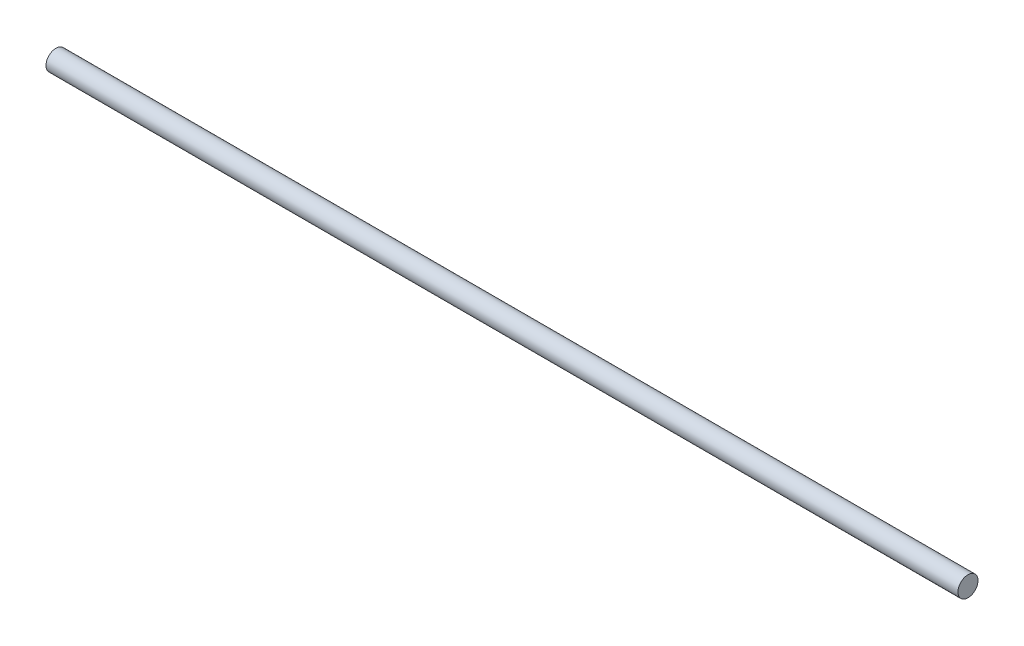
ISO-10303-21;
HEADER;
FILE_DESCRIPTION(('STEP AP214'),'2;1');
FILE_NAME('part.step','',(''),(''),'','','');
FILE_SCHEMA(('AUTOMOTIVE_DESIGN { 1 0 10303 214 1 1 1 1 }'));
ENDSEC;
DATA;
#1=APPLICATION_CONTEXT('core data for automotive mechanical design processes');
#2=APPLICATION_PROTOCOL_DEFINITION('international standard','automotive_design',2000,#1);
#3=PRODUCT_CONTEXT('',#1,'mechanical');
#4=PRODUCT('Part','Part','',(#3));
#5=PRODUCT_RELATED_PRODUCT_CATEGORY('part','',(#4));
#6=PRODUCT_DEFINITION_FORMATION('','',#4);
#7=PRODUCT_DEFINITION_CONTEXT('part definition',#1,'design');
#8=PRODUCT_DEFINITION('design','',#6,#7);
#9=PRODUCT_DEFINITION_SHAPE('','',#8);
#10=(LENGTH_UNIT() NAMED_UNIT(*) SI_UNIT(.MILLI.,.METRE.));
#11=(NAMED_UNIT(*) PLANE_ANGLE_UNIT() SI_UNIT($,.RADIAN.));
#12=(NAMED_UNIT(*) SI_UNIT($,.STERADIAN.) SOLID_ANGLE_UNIT());
#13=UNCERTAINTY_MEASURE_WITH_UNIT(LENGTH_MEASURE(1.E-05),#10,'distance_accuracy_value','');
#14=(GEOMETRIC_REPRESENTATION_CONTEXT(3) GLOBAL_UNCERTAINTY_ASSIGNED_CONTEXT((#13)) GLOBAL_UNIT_ASSIGNED_CONTEXT((#10,
#11,#12)) REPRESENTATION_CONTEXT('',''));
#15=CARTESIAN_POINT('',(0.,0.,0.));
#16=DIRECTION('',(0.,0.,1.));
#17=DIRECTION('',(1.,0.,0.));
#18=AXIS2_PLACEMENT_3D('',#15,#16,#17);
#19=CARTESIAN_POINT('',(508.,0.,0.));
#20=DIRECTION('',(-1.,0.,0.));
#21=DIRECTION('',(0.,0.,1.));
#22=AXIS2_PLACEMENT_3D('',#19,#20,#21);
#23=CYLINDRICAL_SURFACE('',#22,5.588);
#24=CARTESIAN_POINT('',(508.,0.,0.));
#25=DIRECTION('',(1.,0.,0.));
#26=DIRECTION('',(0.,0.,-1.));
#27=AXIS2_PLACEMENT_3D('',#24,#25,#26);
#28=CIRCLE('',#27,5.588);
#29=CARTESIAN_POINT('',(508.,0.,-5.588));
#30=VERTEX_POINT('',#29);
#31=EDGE_CURVE('E10',#30,#30,#28,.T.);
#32=ORIENTED_EDGE('',*,*,#31,.F.);
#33=EDGE_LOOP('',(#32));
#34=FACE_BOUND('',#33,.T.);
#35=CARTESIAN_POINT('',(0.,0.,0.));
#36=DIRECTION('',(1.,0.,0.));
#37=DIRECTION('',(0.,0.,-1.));
#38=AXIS2_PLACEMENT_3D('',#35,#36,#37);
#39=CIRCLE('',#38,5.588);
#40=CARTESIAN_POINT('',(0.,0.,-5.588));
#41=VERTEX_POINT('',#40);
#42=EDGE_CURVE('E45',#41,#41,#39,.T.);
#43=ORIENTED_EDGE('',*,*,#42,.T.);
#44=EDGE_LOOP('',(#43));
#45=FACE_BOUND('',#44,.T.);
#46=ADVANCED_FACE('F42',(#34,#45),#23,.T.);
#47=CARTESIAN_POINT('',(508.,0.,0.));
#48=DIRECTION('',(1.,0.,0.));
#49=DIRECTION('',(0.,0.,-1.));
#50=AXIS2_PLACEMENT_3D('',#47,#48,#49);
#51=PLANE('',#50);
#52=ORIENTED_EDGE('',*,*,#31,.T.);
#53=EDGE_LOOP('',(#52));
#54=FACE_BOUND('',#53,.T.);
#55=ADVANCED_FACE('F59',(#54),#51,.T.);
#56=CARTESIAN_POINT('',(0.,0.,0.));
#57=DIRECTION('',(1.,0.,0.));
#58=DIRECTION('',(0.,0.,-1.));
#59=AXIS2_PLACEMENT_3D('',#56,#57,#58);
#60=PLANE('',#59);
#61=ORIENTED_EDGE('',*,*,#42,.F.);
#62=EDGE_LOOP('',(#61));
#63=FACE_BOUND('',#62,.T.);
#64=ADVANCED_FACE('F57',(#63),#60,.F.);
#65=CLOSED_SHELL('',(#46,#55,#64));
#66=MANIFOLD_SOLID_BREP('B2',#65);
#67=ADVANCED_BREP_SHAPE_REPRESENTATION('',(#18,#66),#14);
#68=SHAPE_DEFINITION_REPRESENTATION(#9,#67);
ENDSEC;
END-ISO-10303-21;
